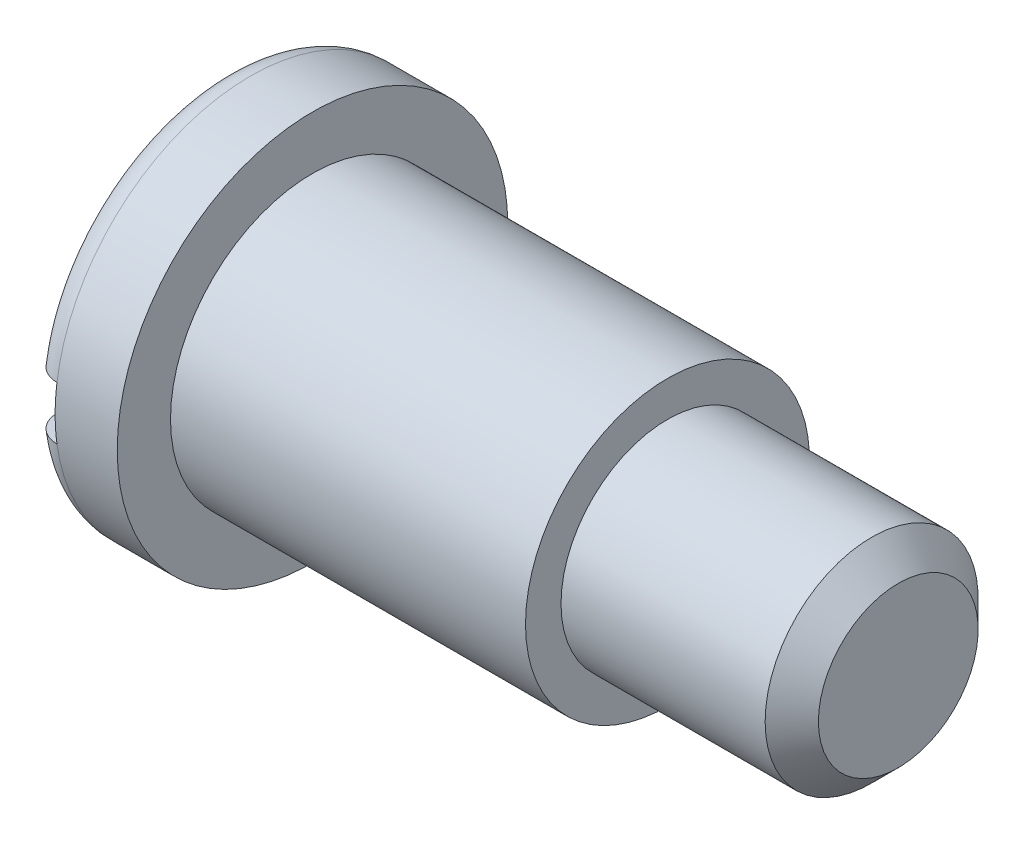
ISO-10303-21;
HEADER;
FILE_DESCRIPTION(('STEP AP214'),'2;1');
FILE_NAME('part.step','',(''),(''),'','','');
FILE_SCHEMA(('AUTOMOTIVE_DESIGN { 1 0 10303 214 1 1 1 1 }'));
ENDSEC;
DATA;
#1=APPLICATION_CONTEXT('core data for automotive mechanical design processes');
#2=APPLICATION_PROTOCOL_DEFINITION('international standard','automotive_design',2000,#1);
#3=PRODUCT_CONTEXT('',#1,'mechanical');
#4=PRODUCT('Part','Part','',(#3));
#5=PRODUCT_RELATED_PRODUCT_CATEGORY('part','',(#4));
#6=PRODUCT_DEFINITION_FORMATION('','',#4);
#7=PRODUCT_DEFINITION_CONTEXT('part definition',#1,'design');
#8=PRODUCT_DEFINITION('design','',#6,#7);
#9=PRODUCT_DEFINITION_SHAPE('','',#8);
#10=(LENGTH_UNIT() NAMED_UNIT(*) SI_UNIT(.MILLI.,.METRE.));
#11=(NAMED_UNIT(*) PLANE_ANGLE_UNIT() SI_UNIT($,.RADIAN.));
#12=(NAMED_UNIT(*) SI_UNIT($,.STERADIAN.) SOLID_ANGLE_UNIT());
#13=UNCERTAINTY_MEASURE_WITH_UNIT(LENGTH_MEASURE(1.E-05),#10,'distance_accuracy_value','');
#14=(GEOMETRIC_REPRESENTATION_CONTEXT(3) GLOBAL_UNCERTAINTY_ASSIGNED_CONTEXT((#13)) GLOBAL_UNIT_ASSIGNED_CONTEXT((#10,
#11,#12)) REPRESENTATION_CONTEXT('',''));
#15=CARTESIAN_POINT('',(0.,0.,0.));
#16=DIRECTION('',(0.,0.,1.));
#17=DIRECTION('',(1.,0.,0.));
#18=AXIS2_PLACEMENT_3D('',#15,#16,#17);
#19=CARTESIAN_POINT('',(1.5,0.,0.));
#20=DIRECTION('',(1.,0.,0.));
#21=DIRECTION('',(0.,0.,-1.));
#22=AXIS2_PLACEMENT_3D('',#19,#20,#21);
#23=TOROIDAL_SURFACE('',#22,9.5,1.5);
#24=CARTESIAN_POINT('',(0.550426437930369,-1.5,-10.5551169232429));
#25=CARTESIAN_POINT('',(0.48487725948307,-1.5,-10.5009686890655));
#26=CARTESIAN_POINT('',(0.423886464196567,-1.5,-10.4411986207992));
#27=CARTESIAN_POINT('',(0.312787402543928,-1.5,-10.3121903853188));
#28=CARTESIAN_POINT('',(0.262693625799049,-1.5,-10.2429398088348));
#29=CARTESIAN_POINT('',(0.174854492196715,-1.5,-10.0970888983895));
#30=CARTESIAN_POINT('',(0.137097718729304,-1.5,-10.0204954448946));
#31=CARTESIAN_POINT('',(0.0748785985011941,-1.5,-9.8621158407729));
#32=CARTESIAN_POINT('',(0.0504129746804633,-1.5,-9.78033097569738));
#33=CARTESIAN_POINT('',(0.0152393494835525,-1.5,-9.6131872625903));
#34=CARTESIAN_POINT('',(0.00464024878253395,-1.5,-9.52780549658987));
#35=CARTESIAN_POINT('',(-0.0021959106967803,-1.5,-9.35646443957624));
#36=CARTESIAN_POINT('',(0.00156837940479324,-1.5,-9.27050509507883));
#37=CARTESIAN_POINT('',(0.0234208569005784,-1.5,-9.09973701372606));
#38=CARTESIAN_POINT('',(0.0416214573786582,-1.5,-9.01494264167184));
#39=CARTESIAN_POINT('',(0.0919825133896002,-1.5,-8.84960307441881));
#40=CARTESIAN_POINT('',(0.124143281035294,-1.5,-8.76905797426778));
#41=CARTESIAN_POINT('',(0.201595824433492,-1.5,-8.61444261930739));
#42=CARTESIAN_POINT('',(0.246900932366783,-1.5,-8.5403790384181));
#43=CARTESIAN_POINT('',(0.349400940396528,-1.5,-8.40099071710601));
#44=CARTESIAN_POINT('',(0.406595431321901,-1.5,-8.33566567607497));
#45=CARTESIAN_POINT('',(0.53076775646425,-1.5,-8.21623537916519));
#46=CARTESIAN_POINT('',(0.597658945512793,-1.5,-8.16204008203144));
#47=CARTESIAN_POINT('',(0.739710636348902,-1.5,-8.06585891847392));
#48=CARTESIAN_POINT('',(0.8148704007637,-1.5,-8.02387196455239));
#49=CARTESIAN_POINT('',(0.970077953713494,-1.5,-7.95400043530446));
#50=CARTESIAN_POINT('',(1.05003169989471,-1.5,-7.92590696897734));
#51=CARTESIAN_POINT('',(1.21355713481626,-1.5,-7.88376198426108));
#52=CARTESIAN_POINT('',(1.29712847739103,-1.5,-7.86970912542016));
#53=CARTESIAN_POINT('',(1.46423829563021,-1.5,-7.8562018405924));
#54=CARTESIAN_POINT('',(1.54776022322507,-1.5,-7.85654196138834));
#55=CARTESIAN_POINT('',(1.71354816864702,-1.5,-7.87129941755879));
#56=CARTESIAN_POINT('',(1.79581423052833,-1.5,-7.88571625798153));
#57=CARTESIAN_POINT('',(1.95644818601575,-1.5,-7.9280849591151));
#58=CARTESIAN_POINT('',(2.03482953090802,-1.5,-7.95598590224991));
#59=CARTESIAN_POINT('',(2.18585754118622,-1.5,-8.02443384894235));
#60=CARTESIAN_POINT('',(2.25850398699107,-1.5,-8.06498133642408));
#61=CARTESIAN_POINT('',(2.39673957114359,-1.5,-8.15793189713279));
#62=CARTESIAN_POINT('',(2.4622577017332,-1.5,-8.21044051945016));
#63=CARTESIAN_POINT('',(2.58372287968011,-1.5,-8.32555439180791));
#64=CARTESIAN_POINT('',(2.63966915695239,-1.5,-8.3881604534319));
#65=CARTESIAN_POINT('',(2.74134395918012,-1.5,-8.52275858649178));
#66=CARTESIAN_POINT('',(2.78689592835251,-1.5,-8.59488403706388));
#67=CARTESIAN_POINT('',(2.86543150702477,-1.5,-8.74568076935321));
#68=CARTESIAN_POINT('',(2.8984141582276,-1.5,-8.82435254961211));
#69=CARTESIAN_POINT('',(2.9512966379996,-1.5,-8.98713863031047));
#70=CARTESIAN_POINT('',(2.9710165983959,-1.5,-9.07131140777466));
#71=CARTESIAN_POINT('',(2.99612190398796,-1.5,-9.24176993283335));
#72=CARTESIAN_POINT('',(3.00150670981292,-1.5,-9.32805575980964));
#73=CARTESIAN_POINT('',(2.99776099044725,-1.5,-9.5007292125419));
#74=CARTESIAN_POINT('',(2.98856080015987,-1.5,-9.5871153455109));
#75=CARTESIAN_POINT('',(2.9557289263999,-1.5,-9.75710248019678));
#76=CARTESIAN_POINT('',(2.93209742274529,-1.5,-9.840703516603));
#77=CARTESIAN_POINT('',(2.87114217882813,-1.5,-10.0023712139494));
#78=CARTESIAN_POINT('',(2.8338742806269,-1.5,-10.0804589181546));
#79=CARTESIAN_POINT('',(2.74663724426609,-1.5,-10.2291867881588));
#80=CARTESIAN_POINT('',(2.69666866628787,-1.5,-10.2998272822331));
#81=CARTESIAN_POINT('',(2.58594560838509,-1.5,-10.4309368948854));
#82=CARTESIAN_POINT('',(2.52529723490152,-1.5,-10.4914956116091));
#83=CARTESIAN_POINT('',(2.39460054573582,-1.5,-10.6014408198729));
#84=CARTESIAN_POINT('',(2.32455275062574,-1.5,-10.6508279297282));
#85=CARTESIAN_POINT('',(2.17782937305798,-1.5,-10.7364915110606));
#86=CARTESIAN_POINT('',(2.10123008548122,-1.5,-10.7728986767868));
#87=CARTESIAN_POINT('',(1.9429767524133,-1.5,-10.8322185633799));
#88=CARTESIAN_POINT('',(1.86132315259793,-1.5,-10.8551324721783));
#89=CARTESIAN_POINT('',(1.69597361892887,-1.5,-10.8866510283981));
#90=CARTESIAN_POINT('',(1.61229904346528,-1.5,-10.8953678238951));
#91=CARTESIAN_POINT('',(1.44465495676886,-1.5,-10.8985811203969));
#92=CARTESIAN_POINT('',(1.36068538257447,-1.5,-10.8930743750682));
#93=CARTESIAN_POINT('',(1.19510549025376,-1.5,-10.8680388343585));
#94=CARTESIAN_POINT('',(1.11348942080224,-1.5,-10.8485478905327));
#95=CARTESIAN_POINT('',(0.954751559038114,-1.5,-10.7961737533708));
#96=CARTESIAN_POINT('',(0.877624388721411,-1.5,-10.7633069791084));
#97=CARTESIAN_POINT('',(0.758855343780513,-1.5,-10.7004779110153));
#98=CARTESIAN_POINT('',(0.715117111079122,-1.5,-10.6743928280483));
#99=CARTESIAN_POINT('',(0.630517190131584,-1.5,-10.6179153053822));
#100=CARTESIAN_POINT('',(0.589655491132161,-1.5,-10.5875228817865));
#101=CARTESIAN_POINT('',(0.550426437930369,-1.5,-10.5551169232429));
#102=B_SPLINE_CURVE_WITH_KNOTS('',3,(#24,#25,#26,#27,#28,#29,#30,#31,#32,#33,#34,#35,#36,#37,
#38,#39,#40,#41,#42,#43,#44,#45,#46,#47,#48,#49,#50,#51,#52,#53,#54,#55,#56,#57,#58,#59,#60,#61,
#62,#63,#64,#65,#66,#67,#68,#69,#70,#71,#72,#73,#74,#75,#76,#77,#78,#79,#80,#81,#82,#83,#84,#85,
#86,#87,#88,#89,#90,#91,#92,#93,#94,#95,#96,#97,#98,#99,#100,#101),.UNSPECIFIED.,.T.,.F.,(4,2,2,
2,2,2,2,2,2,2,2,2,2,2,2,2,2,2,2,2,2,2,2,2,2,2,2,2,2,2,2,2,2,2,2,2,2,2,4),(0.,0.254877598151955,
0.510092059682809,0.765069673524943,1.01998439163289,1.27688929664779,1.53381832844359,
1.79276789965294,2.05172326059574,2.3109422013008,2.5701522225068,2.82717452122453,
3.08417391782876,3.33718196294704,3.59016585116896,3.83953974475231,4.08890487041218,
4.33733563513736,4.58577590731223,4.83649980936419,5.08724387344928,5.34197371771699,
5.59672297895264,5.85486099533947,6.11300872422289,6.37239321308586,6.63177447001527,
6.89010521627651,7.14842457047312,7.40430903182673,7.66017932726987,7.91339523440181,
8.16658884534917,8.41777251451448,8.66901351806756,8.91957703135377,9.16983389666833,
9.32237042686386,9.47490638680556),.UNSPECIFIED.);
#103=CARTESIAN_POINT('',(1.5,-1.5,-10.8972473588517));
#104=VERTEX_POINT('',#103);
#105=CARTESIAN_POINT('',(0.,-1.5,-9.38083151964686));
#106=VERTEX_POINT('',#105);
#107=EDGE_CURVE('E103',#104,#106,#102,.T.);
#108=ORIENTED_EDGE('',*,*,#107,.F.);
#109=CARTESIAN_POINT('',(1.5,0.,0.));
#110=DIRECTION('',(1.,0.,0.));
#111=DIRECTION('',(0.,0.,-1.));
#112=AXIS2_PLACEMENT_3D('',#109,#110,#111);
#113=CIRCLE('',#112,11.);
#114=CARTESIAN_POINT('',(1.5,-1.5,10.8972473588517));
#115=VERTEX_POINT('',#114);
#116=EDGE_CURVE('E97',#115,#104,#113,.T.);
#117=ORIENTED_EDGE('',*,*,#116,.F.);
#118=CARTESIAN_POINT('',(0.925742203805018,-1.5,7.97442742095423));
#119=CARTESIAN_POINT('',(0.847835040052107,-1.5,8.00728357254015));
#120=CARTESIAN_POINT('',(0.772675593045765,-1.5,8.04682755663));
#121=CARTESIAN_POINT('',(0.630036771750604,-1.5,8.13805969134725));
#122=CARTESIAN_POINT('',(0.562568133244109,-1.5,8.18976451668814));
#123=CARTESIAN_POINT('',(0.437302587501501,-1.5,8.30366732218029));
#124=CARTESIAN_POINT('',(0.379494486511001,-1.5,8.36585298782177));
#125=CARTESIAN_POINT('',(0.275010826432592,-1.5,8.49892773077069));
#126=CARTESIAN_POINT('',(0.228332571850052,-1.5,8.56981469443164));
#127=CARTESIAN_POINT('',(0.146824453874251,-1.5,8.71918157810591));
#128=CARTESIAN_POINT('',(0.112139485972692,-1.5,8.79774057673946));
#129=CARTESIAN_POINT('',(0.0562996290278454,-1.5,8.95953327311284));
#130=CARTESIAN_POINT('',(0.0351461296526283,-1.5,9.04276745003418));
#131=CARTESIAN_POINT('',(0.00680300287144699,-1.5,9.21243392640564));
#132=CARTESIAN_POINT('',(-0.000245865375002168,-1.5,9.29888977721149));
#133=CARTESIAN_POINT('',(0.000258992682460423,-1.5,9.47176083998722));
#134=CARTESIAN_POINT('',(0.00781292495210046,-1.5,9.55817605136671));
#135=CARTESIAN_POINT('',(0.0373622622626743,-1.5,9.72855950564737));
#136=CARTESIAN_POINT('',(0.0593665660253951,-1.5,9.81252620742715));
#137=CARTESIAN_POINT('',(0.117258093719486,-1.5,9.97553119795389));
#138=CARTESIAN_POINT('',(0.153144876966096,-1.5,10.0545696430507));
#139=CARTESIAN_POINT('',(0.237535991581306,-1.5,10.2048722006662));
#140=CARTESIAN_POINT('',(0.28595054881967,-1.5,10.2761867044722));
#141=CARTESIAN_POINT('',(0.394182218275184,-1.5,10.4095651442254));
#142=CARTESIAN_POINT('',(0.45399872970291,-1.5,10.4716295672691));
#143=CARTESIAN_POINT('',(0.582671575350511,-1.5,10.5840588276901));
#144=CARTESIAN_POINT('',(0.651427720450904,-1.5,10.6345383294053));
#145=CARTESIAN_POINT('',(0.796505782908989,-1.5,10.7231051702123));
#146=CARTESIAN_POINT('',(0.872827278255088,-1.5,10.7611932000203));
#147=CARTESIAN_POINT('',(1.03007833768533,-1.5,10.8235238451861));
#148=CARTESIAN_POINT('',(1.11095657370898,-1.5,10.8478959889831));
#149=CARTESIAN_POINT('',(1.27566766618613,-1.5,10.8826250511327));
#150=CARTESIAN_POINT('',(1.35950040728435,-1.5,10.892982516052));
#151=CARTESIAN_POINT('',(1.52720831826648,-1.5,10.8993521477161));
#152=CARTESIAN_POINT('',(1.61108027770034,-1.5,10.8954491669614));
#153=CARTESIAN_POINT('',(1.77697411807047,-1.5,10.8736040516941));
#154=CARTESIAN_POINT('',(1.85899602429511,-1.5,10.8556621091997));
#155=CARTESIAN_POINT('',(2.01880006085097,-1.5,10.8062930547696));
#156=CARTESIAN_POINT('',(2.09658559444603,-1.5,10.7748769528251));
#157=CARTESIAN_POINT('',(2.24581036272823,-1.5,10.6994872886899));
#158=CARTESIAN_POINT('',(2.31724950648665,-1.5,10.6555135466159));
#159=CARTESIAN_POINT('',(2.45210840178164,-1.5,10.5560674504137));
#160=CARTESIAN_POINT('',(2.51549106068121,-1.5,10.5005448089445));
#161=CARTESIAN_POINT('',(2.63213264373006,-1.5,10.3797283575302));
#162=CARTESIAN_POINT('',(2.68539117582962,-1.5,10.3144341693638));
#163=CARTESIAN_POINT('',(2.7807734329815,-1.5,10.1753335807735));
#164=CARTESIAN_POINT('',(2.82279714960029,-1.5,10.1014586144099));
#165=CARTESIAN_POINT('',(2.89399243790659,-1.5,9.94775681755661));
#166=CARTESIAN_POINT('',(2.92316330227346,-1.5,9.86792965978733));
#167=CARTESIAN_POINT('',(2.96814314441398,-1.5,9.7036979334459));
#168=CARTESIAN_POINT('',(2.98380934426379,-1.5,9.61925425644407));
#169=CARTESIAN_POINT('',(3.0008759236901,-1.5,9.44893708268639));
#170=CARTESIAN_POINT('',(3.00227553670974,-1.5,9.36306350934921));
#171=CARTESIAN_POINT('',(2.99075056244142,-1.5,9.19153468459324));
#172=CARTESIAN_POINT('',(2.97770198940849,-1.5,9.10588774416653));
#173=CARTESIAN_POINT('',(2.93745122428083,-1.5,8.93798404258285));
#174=CARTESIAN_POINT('',(2.91024855917847,-1.5,8.85572739482331));
#175=CARTESIAN_POINT('',(2.84233984772641,-1.5,8.69674046570512));
#176=CARTESIAN_POINT('',(2.8015998665325,-1.5,8.62002466830071));
#177=CARTESIAN_POINT('',(2.70773653631275,-1.5,8.47458010591995));
#178=CARTESIAN_POINT('',(2.65461342392193,-1.5,8.40585118835618));
#179=CARTESIAN_POINT('',(2.53783497424086,-1.5,8.27886302255415));
#180=CARTESIAN_POINT('',(2.4742527549984,-1.5,8.22053657060045));
#181=CARTESIAN_POINT('',(2.33807492047928,-1.5,8.11557968422266));
#182=CARTESIAN_POINT('',(2.26548040758221,-1.5,8.06894782142509));
#183=CARTESIAN_POINT('',(2.11448337481241,-1.5,7.98945250088406));
#184=CARTESIAN_POINT('',(2.03618299258155,-1.5,7.95639505230343));
#185=CARTESIAN_POINT('',(1.87506723552025,-1.5,7.90411956336779));
#186=CARTESIAN_POINT('',(1.79225115130433,-1.5,7.88490370420735));
#187=CARTESIAN_POINT('',(1.62580170743322,-1.5,7.86112803579494));
#188=CARTESIAN_POINT('',(1.54219850401388,-1.5,7.85635586879609));
#189=CARTESIAN_POINT('',(1.37546382146303,-1.5,7.86102830307992));
#190=CARTESIAN_POINT('',(1.29233187197819,-1.5,7.8704545197307));
#191=CARTESIAN_POINT('',(1.16183850026559,-1.5,7.89656139443956));
#192=CARTESIAN_POINT('',(1.11354378042277,-1.5,7.90879672845852));
#193=CARTESIAN_POINT('',(1.01842931768031,-1.5,7.93805784760752));
#194=CARTESIAN_POINT('',(0.971609555139528,-1.5,7.95508356891681));
#195=CARTESIAN_POINT('',(0.925742203805018,-1.5,7.97442742095423));
#196=B_SPLINE_CURVE_WITH_KNOTS('',3,(#118,#119,#120,#121,#122,#123,#124,#125,#126,#127,#128,
#129,#130,#131,#132,#133,#134,#135,#136,#137,#138,#139,#140,#141,#142,#143,#144,#145,#146,#147,
#148,#149,#150,#151,#152,#153,#154,#155,#156,#157,#158,#159,#160,#161,#162,#163,#164,#165,#166,
#167,#168,#169,#170,#171,#172,#173,#174,#175,#176,#177,#178,#179,#180,#181,#182,#183,#184,#185,
#186,#187,#188,#189,#190,#191,#192,#193,#194,#195),.UNSPECIFIED.,.T.,.F.,(4,2,2,2,2,2,2,2,2,2,2,
2,2,2,2,2,2,2,2,2,2,2,2,2,2,2,2,2,2,2,2,2,2,2,2,2,2,2,4),(0.,0.253470781336209,
0.507291164301584,0.76081537279319,1.01427811872573,1.27070401908743,1.52715624990241,
1.78615526660405,2.04515793639334,2.30432025306081,2.56347434356717,2.82082042303392,
3.07815294622051,3.33281658884286,3.58746603376236,3.83966846227363,4.09186105471395,
4.34255550119442,4.59324651885588,4.84373308123445,5.09422323191268,5.34582782262237,
5.59744215456005,5.85122684354189,6.10502549710788,6.36147563229395,6.61793954670956,
6.8766214573368,7.13531201326432,7.39465599975419,7.65399503072506,7.91159262843645,
8.16915874791752,8.42290389150328,8.67668901218307,8.92672428758855,9.17643608556787,
9.32566739762002,9.47489672160688),.UNSPECIFIED.);
#197=CARTESIAN_POINT('',(0.,-1.5,9.38083151964686));
#198=VERTEX_POINT('',#197);
#199=EDGE_CURVE('E104',#198,#115,#196,.T.);
#200=ORIENTED_EDGE('',*,*,#199,.F.);
#201=CARTESIAN_POINT('',(0.,0.,0.));
#202=DIRECTION('',(1.,0.,0.));
#203=DIRECTION('',(0.,0.,-1.));
#204=AXIS2_PLACEMENT_3D('',#201,#202,#203);
#205=CIRCLE('',#204,9.5);
#206=EDGE_CURVE('E112',#106,#198,#205,.F.);
#207=ORIENTED_EDGE('',*,*,#206,.F.);
#208=EDGE_LOOP('',(#108,#117,#200,#207));
#209=FACE_BOUND('',#208,.T.);
#210=ADVANCED_FACE('F50',(#209),#23,.T.);
#211=CARTESIAN_POINT('',(0.,0.,0.));
#212=DIRECTION('',(1.,0.,0.));
#213=DIRECTION('',(0.,0.,-1.));
#214=AXIS2_PLACEMENT_3D('',#211,#212,#213);
#215=PLANE('',#214);
#216=ORIENTED_EDGE('',*,*,#206,.T.);
#217=DIRECTION('',(0.,0.,-1.));
#218=VECTOR('',#217,1.);
#219=CARTESIAN_POINT('',(0.,-1.5,0.));
#220=LINE('',#219,#218);
#221=EDGE_CURVE('E13',#198,#106,#220,.T.);
#222=ORIENTED_EDGE('',*,*,#221,.T.);
#223=EDGE_LOOP('',(#216,#222));
#224=FACE_BOUND('',#223,.T.);
#225=ADVANCED_FACE('F174',(#224),#215,.F.);
#226=CARTESIAN_POINT('',(0.550426437930369,1.5,-10.5551169232429));
#227=CARTESIAN_POINT('',(0.615094043160084,1.5,-10.6085271413718));
#228=CARTESIAN_POINT('',(0.684290560753695,1.5,-10.656544285415));
#229=CARTESIAN_POINT('',(0.829810110694883,1.5,-10.7403345923582));
#230=CARTESIAN_POINT('',(0.906140859658025,1.5,-10.776094297518));
#231=CARTESIAN_POINT('',(1.06372401023164,1.5,-10.8342573182901));
#232=CARTESIAN_POINT('',(1.14497541049606,1.5,-10.8566633413649));
#233=CARTESIAN_POINT('',(1.31007317177674,1.5,-10.8874491553901));
#234=CARTESIAN_POINT('',(1.39391891443108,1.5,-10.8958322628719));
#235=CARTESIAN_POINT('',(1.56150428740689,1.5,-10.8983281488776));
#236=CARTESIAN_POINT('',(1.64524311801191,1.5,-10.8924948247618));
#237=CARTESIAN_POINT('',(1.81055208542505,1.5,-10.8668439412036));
#238=CARTESIAN_POINT('',(1.89212217147037,1.5,-10.8470260547294));
#239=CARTESIAN_POINT('',(2.05074611518951,1.5,-10.7940067658012));
#240=CARTESIAN_POINT('',(2.12780203425802,1.5,-10.7608115275486));
#241=CARTESIAN_POINT('',(2.27528302927957,1.5,-10.6820148176048));
#242=CARTESIAN_POINT('',(2.34570800968198,1.5,-10.6364131671762));
#243=CARTESIAN_POINT('',(2.47830336514066,1.5,-10.5338838024172));
#244=CARTESIAN_POINT('',(2.54043264061304,1.5,-10.4769029505989));
#245=CARTESIAN_POINT('',(2.65434478771485,1.5,-10.3534010474264));
#246=CARTESIAN_POINT('',(2.70612725963718,1.5,-10.2868796276812));
#247=CARTESIAN_POINT('',(2.7983741873319,1.5,-10.1455630120249));
#248=CARTESIAN_POINT('',(2.83873454617213,1.5,-10.0706998748126));
#249=CARTESIAN_POINT('',(2.90646238062137,1.5,-9.91531164300066));
#250=CARTESIAN_POINT('',(2.93382912648092,1.5,-9.83478623068684));
#251=CARTESIAN_POINT('',(2.97508964872806,1.5,-9.66945939105014));
#252=CARTESIAN_POINT('',(2.98883961561405,1.5,-9.5846220676939));
#253=CARTESIAN_POINT('',(3.00203089449279,1.5,-9.41384168128676));
#254=CARTESIAN_POINT('',(3.00147143742497,1.5,-9.32789855905276));
#255=CARTESIAN_POINT('',(2.98602150945128,1.5,-9.15658258490279));
#256=CARTESIAN_POINT('',(2.97101112897481,1.5,-9.07122052680261));
#257=CARTESIAN_POINT('',(2.92690398400221,1.5,-8.90421389812354));
#258=CARTESIAN_POINT('',(2.89780681305916,1.5,-8.82256943488299));
#259=CARTESIAN_POINT('',(2.82624207583634,1.5,-8.66516869114327));
#260=CARTESIAN_POINT('',(2.78374834031143,1.5,-8.58942430027825));
#261=CARTESIAN_POINT('',(2.6865588760528,1.5,-8.44621172826623));
#262=CARTESIAN_POINT('',(2.63186345399816,1.5,-8.37874333917499));
#263=CARTESIAN_POINT('',(2.51221884565902,1.5,-8.25456876009476));
#264=CARTESIAN_POINT('',(2.44734840065707,1.5,-8.19778674064191));
#265=CARTESIAN_POINT('',(2.30887109820778,1.5,-8.09611829540891));
#266=CARTESIAN_POINT('',(2.23526498795755,1.5,-8.0512308532972));
#267=CARTESIAN_POINT('',(2.08258793533969,1.5,-7.97535864864194));
#268=CARTESIAN_POINT('',(2.00361601811332,1.5,-7.94417464232228));
#269=CARTESIAN_POINT('',(1.84151066954513,1.5,-7.89573602381591));
#270=CARTESIAN_POINT('',(1.75837764823392,1.5,-7.87848004203555));
#271=CARTESIAN_POINT('',(1.59164179584837,1.5,-7.85861169100804));
#272=CARTESIAN_POINT('',(1.50806449378742,1.5,-7.85578461567301));
#273=CARTESIAN_POINT('',(1.34163544258004,1.5,-7.86428441955656));
#274=CARTESIAN_POINT('',(1.25878366213981,1.5,-7.87561068524332));
#275=CARTESIAN_POINT('',(1.09659935255576,1.5,-7.91195604450465));
#276=CARTESIAN_POINT('',(1.0172507327498,1.5,-7.93690346864407));
#277=CARTESIAN_POINT('',(0.863819132459228,1.5,-7.99966313336368));
#278=CARTESIAN_POINT('',(0.789736310540686,1.5,-8.03747576114844));
#279=CARTESIAN_POINT('',(0.648283429232541,1.5,-8.12516980842451));
#280=CARTESIAN_POINT('',(0.580971275934838,1.5,-8.17514457768323));
#281=CARTESIAN_POINT('',(0.455527475860118,1.5,-8.28552478125873));
#282=CARTESIAN_POINT('',(0.397396561495007,1.5,-8.34593104691996));
#283=CARTESIAN_POINT('',(0.290999378157303,1.5,-8.47646748104703));
#284=CARTESIAN_POINT('',(0.242901346923384,1.5,-8.54673477784958));
#285=CARTESIAN_POINT('',(0.158992162759496,1.5,-8.69425810561119));
#286=CARTESIAN_POINT('',(0.123182002276046,1.5,-8.77151470043389));
#287=CARTESIAN_POINT('',(0.0643734417165538,1.5,-8.93199160977096));
#288=CARTESIAN_POINT('',(0.0415614527385712,1.5,-9.01528028167795));
#289=CARTESIAN_POINT('',(0.0101526990890039,1.5,-9.18449453714359));
#290=CARTESIAN_POINT('',(0.00155599458309926,1.5,-9.27042013186135));
#291=CARTESIAN_POINT('',(-0.00117778109665698,1.5,-9.44299825423651));
#292=CARTESIAN_POINT('',(0.00476851681777407,1.5,-9.52965212188318));
#293=CARTESIAN_POINT('',(0.0311743276009219,1.5,-9.70074590683785));
#294=CARTESIAN_POINT('',(0.0516373252090571,1.5,-9.78518528750955));
#295=CARTESIAN_POINT('',(0.106471994764259,1.5,-9.94915924349053));
#296=CARTESIAN_POINT('',(0.140805712110482,1.5,-10.0287065261528));
#297=CARTESIAN_POINT('',(0.222441418932762,1.5,-10.1807596916319));
#298=CARTESIAN_POINT('',(0.269727219425919,1.5,-10.2532742125881));
#299=CARTESIAN_POINT('',(0.356368067095969,1.5,-10.3641530030567));
#300=CARTESIAN_POINT('',(0.392253545956213,1.5,-10.4052754657252));
#301=CARTESIAN_POINT('',(0.468263554847927,1.5,-10.4833972632165));
#302=CARTESIAN_POINT('',(0.508388061857877,1.5,-10.5203966204291));
#303=CARTESIAN_POINT('',(0.550426437930369,1.5,-10.5551169232429));
#304=B_SPLINE_CURVE_WITH_KNOTS('',3,(#226,#227,#228,#229,#230,#231,#232,#233,#234,#235,#236,
#237,#238,#239,#240,#241,#242,#243,#244,#245,#246,#247,#248,#249,#250,#251,#252,#253,#254,#255,
#256,#257,#258,#259,#260,#261,#262,#263,#264,#265,#266,#267,#268,#269,#270,#271,#272,#273,#274,
#275,#276,#277,#278,#279,#280,#281,#282,#283,#284,#285,#286,#287,#288,#289,#290,#291,#292,#293,
#294,#295,#296,#297,#298,#299,#300,#301,#302,#303),.UNSPECIFIED.,.T.,.F.,(4,2,2,2,2,2,2,2,2,2,2,
2,2,2,2,2,2,2,2,2,2,2,2,2,2,2,2,2,2,2,2,2,2,2,2,2,2,2,4),(0.,0.251419506337804,
0.503114174663923,0.754757794454405,1.00634189010107,1.25697366444299,1.50761130005161,
1.75813357519747,2.00865945977162,2.26038379731366,2.51211785733247,2.76607722786147,
3.02005085961243,3.27667903033676,3.53332099358155,3.79211101741979,4.05090850858567,
4.31021470801987,4.5695143907465,4.82689834263752,5.08426029527342,5.3377453504629,
5.59120547650076,5.84088281711639,6.09054933486823,6.33891468583855,6.5872875125326,
6.83763041417713,7.08799327626664,7.34226614054354,7.59655953668142,7.85441354953865,
8.11226865375092,8.37160539696844,8.63100441514685,8.88969839321216,9.14807049017988,
9.31151129055128,9.47495120334601),.UNSPECIFIED.);
#305=CARTESIAN_POINT('',(0.,1.5,-9.38083151964686));
#306=VERTEX_POINT('',#305);
#307=CARTESIAN_POINT('',(1.5,1.5,-10.8972473588517));
#308=VERTEX_POINT('',#307);
#309=EDGE_CURVE('E131',#306,#308,#304,.T.);
#310=ORIENTED_EDGE('',*,*,#309,.F.);
#311=CARTESIAN_POINT('',(0.,1.5,9.38083151964686));
#312=VERTEX_POINT('',#311);
#313=EDGE_CURVE('E120',#312,#306,#205,.F.);
#314=ORIENTED_EDGE('',*,*,#313,.F.);
#315=CARTESIAN_POINT('',(0.925742203805018,1.5,7.97442742095423));
#316=CARTESIAN_POINT('',(1.00219935454951,1.5,7.94219107153017));
#317=CARTESIAN_POINT('',(1.08141282948377,1.5,7.91634795264688));
#318=CARTESIAN_POINT('',(1.24311362937914,1.5,7.87830282558802));
#319=CARTESIAN_POINT('',(1.32560427495718,1.5,7.86611503868359));
#320=CARTESIAN_POINT('',(1.49144679728933,1.5,7.85580296647611));
#321=CARTESIAN_POINT('',(1.57479844932217,1.5,7.85767509976657));
#322=CARTESIAN_POINT('',(1.73997693594453,1.5,7.87541684998833));
#323=CARTESIAN_POINT('',(1.82180409234574,1.5,7.89128347778392));
#324=CARTESIAN_POINT('',(1.98151114459836,1.5,7.936467261715));
#325=CARTESIAN_POINT('',(2.05939712105281,1.5,7.96576294992224));
#326=CARTESIAN_POINT('',(2.20921571495229,1.5,8.03689217554227));
#327=CARTESIAN_POINT('',(2.28114790036479,1.5,8.07872662180482));
#328=CARTESIAN_POINT('',(2.41778897219285,1.5,8.17414586025455));
#329=CARTESIAN_POINT('',(2.48242062093899,1.5,8.22784120650386));
#330=CARTESIAN_POINT('',(2.60193011887307,1.5,8.3451648962026));
#331=CARTESIAN_POINT('',(2.65680718641487,1.5,8.40879403489194));
#332=CARTESIAN_POINT('',(2.75617611347752,1.5,8.54527055458172));
#333=CARTESIAN_POINT('',(2.80048793222331,1.5,8.6182490371775));
#334=CARTESIAN_POINT('',(2.87641428146846,1.5,8.77053665724366));
#335=CARTESIAN_POINT('',(2.90802788035993,1.5,8.84984625868656));
#336=CARTESIAN_POINT('',(2.95804960472251,1.5,9.01365365796727));
#337=CARTESIAN_POINT('',(2.97628140221194,1.5,9.09820534597613));
#338=CARTESIAN_POINT('',(2.99836021774818,1.5,9.26916827749819));
#339=CARTESIAN_POINT('',(3.00220672459707,1.5,9.35557958698545));
#340=CARTESIAN_POINT('',(2.99536848467522,1.5,9.52819989673526));
#341=CARTESIAN_POINT('',(2.98462141827209,1.5,9.61440644461262));
#342=CARTESIAN_POINT('',(2.94874222983449,1.5,9.78377448059853));
#343=CARTESIAN_POINT('',(2.92361030973178,1.5,9.866936011435));
#344=CARTESIAN_POINT('',(2.8597617980181,1.5,10.0274442221571));
#345=CARTESIAN_POINT('',(2.82110603702934,1.5,10.104815087641));
#346=CARTESIAN_POINT('',(2.73123289180175,1.5,10.2518826299251));
#347=CARTESIAN_POINT('',(2.68001609943184,1.5,10.3215796680875));
#348=CARTESIAN_POINT('',(2.56699397707868,1.5,10.4506012351322));
#349=CARTESIAN_POINT('',(2.50529482657915,1.5,10.5100187679777));
#350=CARTESIAN_POINT('',(2.37270618034645,1.5,10.6175203690112));
#351=CARTESIAN_POINT('',(2.3018172114916,1.5,10.6656050864966));
#352=CARTESIAN_POINT('',(2.15365129531484,1.5,10.7485574058414));
#353=CARTESIAN_POINT('',(2.07644792931474,1.5,10.7835564546104));
#354=CARTESIAN_POINT('',(1.91723142336521,1.5,10.8399827674404));
#355=CARTESIAN_POINT('',(1.83521850946547,1.5,10.8614106687904));
#356=CARTESIAN_POINT('',(1.66938328128192,1.5,10.8899386661384));
#357=CARTESIAN_POINT('',(1.58557953242992,1.5,10.8971467679794));
#358=CARTESIAN_POINT('',(1.41795620803917,1.5,10.8973458465086));
#359=CARTESIAN_POINT('',(1.33413663293578,1.5,10.8903371695788));
#360=CARTESIAN_POINT('',(1.16911479119878,1.5,10.8623539692974));
#361=CARTESIAN_POINT('',(1.08790563160437,1.5,10.8414200563838));
#362=CARTESIAN_POINT('',(0.930141929525047,1.5,10.7862477252937));
#363=CARTESIAN_POINT('',(0.853587405119329,1.5,10.7520092554443));
#364=CARTESIAN_POINT('',(0.707091093678916,1.5,10.6711339427806));
#365=CARTESIAN_POINT('',(0.63716599984153,1.5,10.6244668726374));
#366=CARTESIAN_POINT('',(0.506072148683865,1.5,10.5201338432492));
#367=CARTESIAN_POINT('',(0.444903644626589,1.5,10.4624675659913));
#368=CARTESIAN_POINT('',(0.332575117700061,1.5,10.3373412559634));
#369=CARTESIAN_POINT('',(0.281490351836213,1.5,10.269813677024));
#370=CARTESIAN_POINT('',(0.191250057720445,1.5,10.1272112872272));
#371=CARTESIAN_POINT('',(0.152095147298927,1.5,10.0521360857567));
#372=CARTESIAN_POINT('',(0.08640296678299,1.5,9.89576111517496));
#373=CARTESIAN_POINT('',(0.0599971019459074,1.5,9.8144061458685));
#374=CARTESIAN_POINT('',(0.0210700638627859,1.5,9.64843977408489));
#375=CARTESIAN_POINT('',(0.00854970568227029,1.5,9.56382818074872));
#376=CARTESIAN_POINT('',(-0.00236082997379446,1.5,9.39285881493102));
#377=CARTESIAN_POINT('',(-0.000610330149682767,1.5,9.30649205029892));
#378=CARTESIAN_POINT('',(0.0172810113738838,1.5,9.13526359686944));
#379=CARTESIAN_POINT('',(0.0334219383742854,1.5,9.05040191699668));
#380=CARTESIAN_POINT('',(0.0797697161420342,1.5,8.88412126835819));
#381=CARTESIAN_POINT('',(0.110050871085781,1.5,8.80272299480373));
#382=CARTESIAN_POINT('',(0.183896092042436,1.5,8.64616179389187));
#383=CARTESIAN_POINT('',(0.227463472916615,1.5,8.57100042857865));
#384=CARTESIAN_POINT('',(0.326564692196232,1.5,8.42931263138283));
#385=CARTESIAN_POINT('',(0.382068750777228,1.5,8.36276535902309));
#386=CARTESIAN_POINT('',(0.503547345100355,1.5,8.24014046376788));
#387=CARTESIAN_POINT('',(0.569508493777448,1.5,8.18404965171621));
#388=CARTESIAN_POINT('',(0.684306032207459,1.5,8.10231803921289));
#389=CARTESIAN_POINT('',(0.730596720893202,1.5,8.07303858271757));
#390=CARTESIAN_POINT('',(0.826106175397071,1.5,8.01972192138852));
#391=CARTESIAN_POINT('',(0.875324918977832,1.5,7.99568467674883));
#392=CARTESIAN_POINT('',(0.925742203805018,1.5,7.97442742095423));
#393=B_SPLINE_CURVE_WITH_KNOTS('',3,(#315,#316,#317,#318,#319,#320,#321,#322,#323,#324,#325,
#326,#327,#328,#329,#330,#331,#332,#333,#334,#335,#336,#337,#338,#339,#340,#341,#342,#343,#344,
#345,#346,#347,#348,#349,#350,#351,#352,#353,#354,#355,#356,#357,#358,#359,#360,#361,#362,#363,
#364,#365,#366,#367,#368,#369,#370,#371,#372,#373,#374,#375,#376,#377,#378,#379,#380,#381,#382,
#383,#384,#385,#386,#387,#388,#389,#390,#391,#392),.UNSPECIFIED.,.T.,.F.,(4,2,2,2,2,2,2,2,2,2,2,
2,2,2,2,2,2,2,2,2,2,2,2,2,2,2,2,2,2,2,2,2,2,2,2,2,2,2,4),(0.,0.248727780785989,
0.497714357681489,0.746637513740803,0.995507514257263,1.24398104693365,1.49247259413313,
1.74338614027805,1.99431978336788,2.24926482861832,2.50422857455702,2.76249438136736,
3.02076936586432,3.28015074982385,3.53952849272784,3.79775423703293,4.05596781621939,
4.31170679875281,4.56743112552456,4.8205128749612,5.07358273902495,5.32472290635736,
5.57585695490903,5.8262618085393,6.07666763471159,6.32768811872229,6.5787158614221,
6.83155157938599,7.08440038913066,7.33980246077427,7.59521952347381,7.85315742327986,
8.11109685205326,8.37040722443992,8.62978234675184,8.88851773076968,9.14692451995869,
9.31094154743421,9.47495732942729),.UNSPECIFIED.);
#394=CARTESIAN_POINT('',(1.5,1.5,10.8972473588517));
#395=VERTEX_POINT('',#394);
#396=EDGE_CURVE('E106',#395,#312,#393,.T.);
#397=ORIENTED_EDGE('',*,*,#396,.F.);
#398=EDGE_CURVE('E100',#308,#395,#113,.T.);
#399=ORIENTED_EDGE('',*,*,#398,.F.);
#400=EDGE_LOOP('',(#310,#314,#397,#399));
#401=FACE_BOUND('',#400,.T.);
#402=ADVANCED_FACE('F52',(#401),#23,.T.);
#403=ORIENTED_EDGE('',*,*,#313,.T.);
#404=DIRECTION('',(0.,0.,1.));
#405=VECTOR('',#404,1.);
#406=CARTESIAN_POINT('',(0.,1.5,0.));
#407=LINE('',#406,#405);
#408=EDGE_CURVE('E59',#306,#312,#407,.T.);
#409=ORIENTED_EDGE('',*,*,#408,.T.);
#410=EDGE_LOOP('',(#403,#409));
#411=FACE_BOUND('',#410,.T.);
#412=ADVANCED_FACE('F126',(#411),#215,.F.);
#413=CARTESIAN_POINT('',(-97.3188570558131,0.,0.));
#414=DIRECTION('',(-1.,0.,0.));
#415=DIRECTION('',(0.,0.,1.));
#416=AXIS2_PLACEMENT_3D('',#413,#414,#415);
#417=CYLINDRICAL_SURFACE('',#416,11.);
#418=ORIENTED_EDGE('',*,*,#398,.T.);
#419=EDGE_CURVE('E117',#395,#115,#113,.T.);
#420=ORIENTED_EDGE('',*,*,#419,.T.);
#421=ORIENTED_EDGE('',*,*,#116,.T.);
#422=EDGE_CURVE('E89',#104,#308,#113,.T.);
#423=ORIENTED_EDGE('',*,*,#422,.T.);
#424=EDGE_LOOP('',(#418,#420,#421,#423));
#425=FACE_BOUND('',#424,.T.);
#426=CARTESIAN_POINT('',(5.00000000000002,0.,0.));
#427=DIRECTION('',(-1.,0.,0.));
#428=DIRECTION('',(0.,0.,1.));
#429=AXIS2_PLACEMENT_3D('',#426,#427,#428);
#430=CIRCLE('',#429,11.);
#431=CARTESIAN_POINT('',(5.00000000000002,0.,11.));
#432=VERTEX_POINT('',#431);
#433=EDGE_CURVE('E277',#432,#432,#430,.T.);
#434=ORIENTED_EDGE('',*,*,#433,.T.);
#435=EDGE_LOOP('',(#434));
#436=FACE_BOUND('',#435,.T.);
#437=ADVANCED_FACE('F115',(#425,#436),#417,.T.);
#438=CARTESIAN_POINT('',(5.00000000000001,11.,0.));
#439=DIRECTION('',(-1.,0.,0.));
#440=DIRECTION('',(0.,0.,1.));
#441=AXIS2_PLACEMENT_3D('',#438,#439,#440);
#442=PLANE('',#441);
#443=ORIENTED_EDGE('',*,*,#433,.F.);
#444=EDGE_LOOP('',(#443));
#445=FACE_BOUND('',#444,.T.);
#446=CARTESIAN_POINT('',(5.00000000000002,0.,0.));
#447=DIRECTION('',(-1.,0.,0.));
#448=DIRECTION('',(0.,0.,1.));
#449=AXIS2_PLACEMENT_3D('',#446,#447,#448);
#450=CIRCLE('',#449,8.);
#451=CARTESIAN_POINT('',(5.00000000000002,0.,8.));
#452=VERTEX_POINT('',#451);
#453=EDGE_CURVE('E279',#452,#452,#450,.T.);
#454=ORIENTED_EDGE('',*,*,#453,.T.);
#455=EDGE_LOOP('',(#454));
#456=FACE_BOUND('',#455,.T.);
#457=ADVANCED_FACE('F166',(#445,#456),#442,.F.);
#458=CARTESIAN_POINT('',(-97.3188570558131,0.,0.));
#459=DIRECTION('',(-1.,0.,0.));
#460=DIRECTION('',(0.,0.,1.));
#461=AXIS2_PLACEMENT_3D('',#458,#459,#460);
#462=CYLINDRICAL_SURFACE('',#461,8.);
#463=ORIENTED_EDGE('',*,*,#453,.F.);
#464=EDGE_LOOP('',(#463));
#465=FACE_BOUND('',#464,.T.);
#466=CARTESIAN_POINT('',(25.,0.,0.));
#467=DIRECTION('',(-1.,0.,0.));
#468=DIRECTION('',(0.,0.,1.));
#469=AXIS2_PLACEMENT_3D('',#466,#467,#468);
#470=CIRCLE('',#469,8.);
#471=CARTESIAN_POINT('',(25.,0.,8.));
#472=VERTEX_POINT('',#471);
#473=EDGE_CURVE('E284',#472,#472,#470,.T.);
#474=ORIENTED_EDGE('',*,*,#473,.T.);
#475=EDGE_LOOP('',(#474));
#476=FACE_BOUND('',#475,.T.);
#477=ADVANCED_FACE('F162',(#465,#476),#462,.T.);
#478=CARTESIAN_POINT('',(25.,8.,0.));
#479=DIRECTION('',(-1.,0.,0.));
#480=DIRECTION('',(0.,0.,1.));
#481=AXIS2_PLACEMENT_3D('',#478,#479,#480);
#482=PLANE('',#481);
#483=ORIENTED_EDGE('',*,*,#473,.F.);
#484=EDGE_LOOP('',(#483));
#485=FACE_BOUND('',#484,.T.);
#486=CARTESIAN_POINT('',(25.,0.,0.));
#487=DIRECTION('',(-1.,0.,0.));
#488=DIRECTION('',(0.,0.,1.));
#489=AXIS2_PLACEMENT_3D('',#486,#487,#488);
#490=CIRCLE('',#489,6.);
#491=CARTESIAN_POINT('',(25.,0.,6.));
#492=VERTEX_POINT('',#491);
#493=EDGE_CURVE('E113',#492,#492,#490,.T.);
#494=ORIENTED_EDGE('',*,*,#493,.T.);
#495=EDGE_LOOP('',(#494));
#496=FACE_BOUND('',#495,.T.);
#497=ADVANCED_FACE('F158',(#485,#496),#482,.F.);
#498=CARTESIAN_POINT('',(-97.3188570558131,0.,0.));
#499=DIRECTION('',(-1.,0.,0.));
#500=DIRECTION('',(0.,0.,1.));
#501=AXIS2_PLACEMENT_3D('',#498,#499,#500);
#502=CYLINDRICAL_SURFACE('',#501,6.);
#503=CARTESIAN_POINT('',(36.5,0.,0.));
#504=DIRECTION('',(-1.,0.,0.));
#505=DIRECTION('',(0.,0.,1.));
#506=AXIS2_PLACEMENT_3D('',#503,#504,#505);
#507=CIRCLE('',#506,6.);
#508=CARTESIAN_POINT('',(36.5,0.,6.));
#509=VERTEX_POINT('',#508);
#510=EDGE_CURVE('E276',#509,#509,#507,.T.);
#511=ORIENTED_EDGE('',*,*,#510,.T.);
#512=EDGE_LOOP('',(#511));
#513=FACE_BOUND('',#512,.T.);
#514=ORIENTED_EDGE('',*,*,#493,.F.);
#515=EDGE_LOOP('',(#514));
#516=FACE_BOUND('',#515,.T.);
#517=ADVANCED_FACE('F154',(#513,#516),#502,.T.);
#518=CARTESIAN_POINT('',(38.,6.,0.));
#519=DIRECTION('',(-1.,0.,0.));
#520=DIRECTION('',(0.,0.,1.));
#521=AXIS2_PLACEMENT_3D('',#518,#519,#520);
#522=PLANE('',#521);
#523=CARTESIAN_POINT('',(38.,0.,0.));
#524=DIRECTION('',(-1.,0.,0.));
#525=DIRECTION('',(0.,0.,1.));
#526=AXIS2_PLACEMENT_3D('',#523,#524,#525);
#527=CIRCLE('',#526,4.50000000000002);
#528=CARTESIAN_POINT('',(38.,0.,4.50000000000002));
#529=VERTEX_POINT('',#528);
#530=EDGE_CURVE('E98',#529,#529,#527,.F.);
#531=ORIENTED_EDGE('',*,*,#530,.T.);
#532=EDGE_LOOP('',(#531));
#533=FACE_BOUND('',#532,.T.);
#534=ADVANCED_FACE('F149',(#533),#522,.F.);
#535=CARTESIAN_POINT('',(36.5,0.,0.));
#536=DIRECTION('',(-1.,0.,0.));
#537=DIRECTION('',(0.,0.,1.));
#538=AXIS2_PLACEMENT_3D('',#535,#536,#537);
#539=CONICAL_SURFACE('',#538,6.,0.785398163397451);
#540=ORIENTED_EDGE('',*,*,#530,.F.);
#541=EDGE_LOOP('',(#540));
#542=FACE_BOUND('',#541,.T.);
#543=ORIENTED_EDGE('',*,*,#510,.F.);
#544=EDGE_LOOP('',(#543));
#545=FACE_BOUND('',#544,.T.);
#546=ADVANCED_FACE('F153',(#542,#545),#539,.T.);
#547=CARTESIAN_POINT('',(1.5,0.,0.));
#548=DIRECTION('',(-1.,0.,0.));
#549=DIRECTION('',(0.,0.,1.));
#550=AXIS2_PLACEMENT_3D('',#547,#548,#549);
#551=PLANE('',#550);
#552=ORIENTED_EDGE('',*,*,#422,.F.);
#553=DIRECTION('',(0.,0.,1.));
#554=VECTOR('',#553,1.);
#555=CARTESIAN_POINT('',(1.5,-1.5,-11.8839385179369));
#556=LINE('',#555,#554);
#557=EDGE_CURVE('E66',#104,#115,#556,.T.);
#558=ORIENTED_EDGE('',*,*,#557,.T.);
#559=ORIENTED_EDGE('',*,*,#419,.F.);
#560=DIRECTION('',(0.,0.,-1.));
#561=VECTOR('',#560,1.);
#562=CARTESIAN_POINT('',(1.5,1.5,-11.8839385179369));
#563=LINE('',#562,#561);
#564=EDGE_CURVE('E92',#395,#308,#563,.T.);
#565=ORIENTED_EDGE('',*,*,#564,.T.);
#566=EDGE_LOOP('',(#552,#558,#559,#565));
#567=FACE_BOUND('',#566,.T.);
#568=ADVANCED_FACE('F90',(#567),#551,.T.);
#569=CARTESIAN_POINT('',(1.5,-1.5,-11.8839385179369));
#570=DIRECTION('',(0.,-1.,0.));
#571=DIRECTION('',(0.,0.,-1.));
#572=AXIS2_PLACEMENT_3D('',#569,#570,#571);
#573=PLANE('',#572);
#574=ORIENTED_EDGE('',*,*,#107,.T.);
#575=ORIENTED_EDGE('',*,*,#221,.F.);
#576=ORIENTED_EDGE('',*,*,#199,.T.);
#577=ORIENTED_EDGE('',*,*,#557,.F.);
#578=EDGE_LOOP('',(#574,#575,#576,#577));
#579=FACE_BOUND('',#578,.T.);
#580=ADVANCED_FACE('F102',(#579),#573,.F.);
#581=CARTESIAN_POINT('',(1.5,1.5,-11.8839385179369));
#582=DIRECTION('',(0.,1.,0.));
#583=DIRECTION('',(0.,0.,1.));
#584=AXIS2_PLACEMENT_3D('',#581,#582,#583);
#585=PLANE('',#584);
#586=ORIENTED_EDGE('',*,*,#309,.T.);
#587=ORIENTED_EDGE('',*,*,#564,.F.);
#588=ORIENTED_EDGE('',*,*,#396,.T.);
#589=ORIENTED_EDGE('',*,*,#408,.F.);
#590=EDGE_LOOP('',(#586,#587,#588,#589));
#591=FACE_BOUND('',#590,.T.);
#592=ADVANCED_FACE('F143',(#591),#585,.F.);
#593=CLOSED_SHELL('',(#210,#225,#402,#412,#437,#457,#477,#497,#517,#534,#546,#568,#580,#592));
#594=MANIFOLD_SOLID_BREP('B2',#593);
#595=ADVANCED_BREP_SHAPE_REPRESENTATION('',(#18,#594),#14);
#596=SHAPE_DEFINITION_REPRESENTATION(#9,#595);
ENDSEC;
END-ISO-10303-21;
